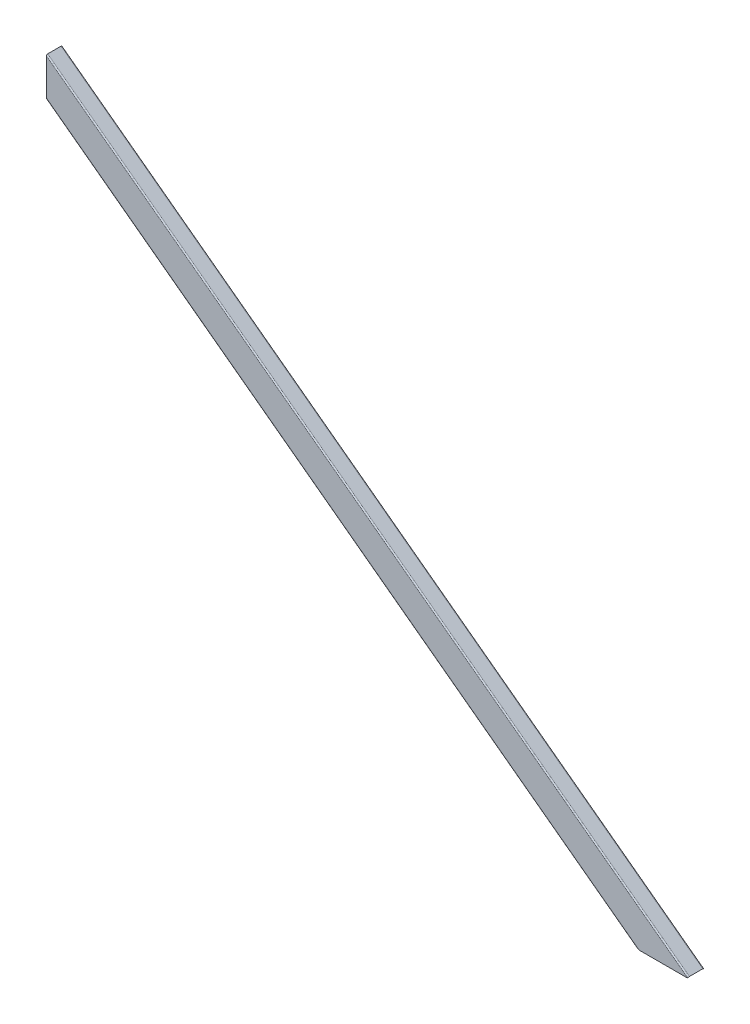
ISO-10303-21;
HEADER;
FILE_DESCRIPTION(('STEP AP214'),'2;1');
FILE_NAME('part.step','',(''),(''),'','','');
FILE_SCHEMA(('AUTOMOTIVE_DESIGN { 1 0 10303 214 1 1 1 1 }'));
ENDSEC;
DATA;
#1=APPLICATION_CONTEXT('core data for automotive mechanical design processes');
#2=APPLICATION_PROTOCOL_DEFINITION('international standard','automotive_design',2000,#1);
#3=PRODUCT_CONTEXT('',#1,'mechanical');
#4=PRODUCT('Part','Part','',(#3));
#5=PRODUCT_RELATED_PRODUCT_CATEGORY('part','',(#4));
#6=PRODUCT_DEFINITION_FORMATION('','',#4);
#7=PRODUCT_DEFINITION_CONTEXT('part definition',#1,'design');
#8=PRODUCT_DEFINITION('design','',#6,#7);
#9=PRODUCT_DEFINITION_SHAPE('','',#8);
#10=(LENGTH_UNIT() NAMED_UNIT(*) SI_UNIT(.MILLI.,.METRE.));
#11=(NAMED_UNIT(*) PLANE_ANGLE_UNIT() SI_UNIT($,.RADIAN.));
#12=(NAMED_UNIT(*) SI_UNIT($,.STERADIAN.) SOLID_ANGLE_UNIT());
#13=UNCERTAINTY_MEASURE_WITH_UNIT(LENGTH_MEASURE(1.E-05),#10,'distance_accuracy_value','');
#14=(GEOMETRIC_REPRESENTATION_CONTEXT(3) GLOBAL_UNCERTAINTY_ASSIGNED_CONTEXT((#13)) GLOBAL_UNIT_ASSIGNED_CONTEXT((#10,
#11,#12)) REPRESENTATION_CONTEXT('',''));
#15=CARTESIAN_POINT('',(0.,0.,0.));
#16=DIRECTION('',(0.,0.,1.));
#17=DIRECTION('',(1.,0.,0.));
#18=AXIS2_PLACEMENT_3D('',#15,#16,#17);
#19=CARTESIAN_POINT('',(-29.2392831235084,628.7958704326,1.500000000002));
#20=DIRECTION('',(0.,0.,1.));
#21=DIRECTION('',(0.,-1.,0.));
#22=AXIS2_PLACEMENT_3D('',#19,#20,#21);
#23=PLANE('',#22);
#24=DIRECTION('',(0.801911703745771,-0.597442565771434,0.));
#25=VECTOR('',#24,1.);
#26=CARTESIAN_POINT('',(-51.3446580570515,599.125137394006,1.500000000002));
#27=LINE('',#26,#25);
#28=CARTESIAN_POINT('',(1.11022302462516E-13,560.872192456334,1.500000000002));
#29=VERTEX_POINT('',#28);
#30=CARTESIAN_POINT('',(754.838822723645,-1.50000000000003,1.50000000000178));
#31=VERTEX_POINT('',#30);
#32=EDGE_CURVE('E225',#29,#31,#27,.T.);
#33=ORIENTED_EDGE('',*,*,#32,.T.);
#34=DIRECTION('',(1.,0.,0.));
#35=VECTOR('',#34,1.);
#36=CARTESIAN_POINT('',(-732.733197448332,-1.50000000000003,1.50000000000178));
#37=LINE('',#36,#35);
#38=CARTESIAN_POINT('',(816.149268234023,-1.50000000000003,1.50000000000178));
#39=VERTEX_POINT('',#38);
#40=EDGE_CURVE('E228',#31,#39,#37,.T.);
#41=ORIENTED_EDGE('',*,*,#40,.T.);
#42=DIRECTION('',(-0.597442565771434,-0.801911703745771,0.));
#43=VECTOR('',#42,1.);
#44=CARTESIAN_POINT('',(816.370638703011,-1.20286755561877,1.50000000000189));
#45=LINE('',#44,#43);
#46=CARTESIAN_POINT('',(816.370638703011,-1.20286755561877,1.50000000000189));
#47=VERTEX_POINT('',#46);
#48=EDGE_CURVE('E190',#47,#39,#45,.T.);
#49=ORIENTED_EDGE('',*,*,#48,.F.);
#50=DIRECTION('',(0.801911703745771,-0.597442565771434,0.));
#51=VECTOR('',#50,1.);
#52=CARTESIAN_POINT('',(-29.2392831235084,628.7958704326,1.500000000002));
#53=LINE('',#52,#51);
#54=CARTESIAN_POINT('',(1.11022302462516E-13,607.011935556692,1.500000000002));
#55=VERTEX_POINT('',#54);
#56=EDGE_CURVE('E222',#55,#47,#53,.T.);
#57=ORIENTED_EDGE('',*,*,#56,.F.);
#58=DIRECTION('',(0.,-1.,0.));
#59=VECTOR('',#58,1.);
#60=CARTESIAN_POINT('',(1.11022302462516E-13,628.7958704326,1.500000000002));
#61=LINE('',#60,#59);
#62=EDGE_CURVE('E209',#55,#29,#61,.T.);
#63=ORIENTED_EDGE('',*,*,#62,.T.);
#64=EDGE_LOOP('',(#33,#41,#49,#57,#63));
#65=FACE_BOUND('',#64,.T.);
#66=ADVANCED_FACE('F34',(#65),#23,.T.);
#67=CARTESIAN_POINT('',(-29.8367256892799,627.993958728854,1.99840144432528E-12));
#68=DIRECTION('',(0.,0.,1.));
#69=DIRECTION('',(0.,-1.,0.));
#70=AXIS2_PLACEMENT_3D('',#67,#68,#69);
#71=PLANE('',#70);
#72=DIRECTION('',(0.801911703745771,-0.597442565771434,0.));
#73=VECTOR('',#72,1.);
#74=CARTESIAN_POINT('',(-29.8367256892799,627.993958728854,1.99840144432528E-12));
#75=LINE('',#74,#73);
#76=CARTESIAN_POINT('',(1.11022302462516E-13,605.764915472898,1.99840144432528E-12));
#77=VERTEX_POINT('',#76);
#78=CARTESIAN_POINT('',(813.082299901155,0.,1.88737914186277E-12));
#79=VERTEX_POINT('',#78);
#80=EDGE_CURVE('E205',#77,#79,#75,.T.);
#81=ORIENTED_EDGE('',*,*,#80,.T.);
#82=DIRECTION('',(1.,0.,0.));
#83=VECTOR('',#82,1.);
#84=CARTESIAN_POINT('',(-732.733197448332,0.,1.77635683940025E-12));
#85=LINE('',#84,#83);
#86=CARTESIAN_POINT('',(754.499262793969,0.,1.77635683940025E-12));
#87=VERTEX_POINT('',#86);
#88=EDGE_CURVE('E304',#87,#79,#85,.T.);
#89=ORIENTED_EDGE('',*,*,#88,.F.);
#90=DIRECTION('',(0.801911703745771,-0.597442565771434,0.));
#91=VECTOR('',#90,1.);
#92=CARTESIAN_POINT('',(-50.74721549128,599.927049097752,1.99840144432528E-12));
#93=LINE('',#92,#91);
#94=CARTESIAN_POINT('',(1.11022302462516E-13,562.119212540127,1.99840144432528E-12));
#95=VERTEX_POINT('',#94);
#96=EDGE_CURVE('E210',#95,#87,#93,.T.);
#97=ORIENTED_EDGE('',*,*,#96,.F.);
#98=DIRECTION('',(0.,-1.,0.));
#99=VECTOR('',#98,1.);
#100=CARTESIAN_POINT('',(1.11022302462516E-13,627.993958728854,1.99840144432528E-12));
#101=LINE('',#100,#99);
#102=EDGE_CURVE('E269',#77,#95,#101,.T.);
#103=ORIENTED_EDGE('',*,*,#102,.F.);
#104=EDGE_LOOP('',(#81,#89,#97,#103));
#105=FACE_BOUND('',#104,.T.);
#106=ADVANCED_FACE('F320',(#105),#71,.F.);
#107=CARTESIAN_POINT('',(816.370638703011,-1.20286755561877,-16.9999999999981));
#108=DIRECTION('',(-0.801911703745771,0.597442565771435,0.));
#109=DIRECTION('',(-0.597442565771435,-0.801911703745771,0.));
#110=AXIS2_PLACEMENT_3D('',#107,#108,#109);
#111=PLANE('',#110);
#112=CARTESIAN_POINT('',(816.370638703011,-1.20286755561877,-16.9999999999981));
#113=DIRECTION('',(0.801911703745771,-0.597442565771435,0.));
#114=DIRECTION('',(-0.597442565771435,-0.801911703745771,0.));
#115=AXIS2_PLACEMENT_3D('',#112,#113,#114);
#116=CIRCLE('',#115,1.49999999999999);
#117=CARTESIAN_POINT('',(816.370638703011,-1.20286755561877,-18.4999999999981));
#118=VERTEX_POINT('',#117);
#119=CARTESIAN_POINT('',(817.266802551668,0.,-16.9999999999981));
#120=VERTEX_POINT('',#119);
#121=EDGE_CURVE('E208',#118,#120,#116,.T.);
#122=ORIENTED_EDGE('',*,*,#121,.T.);
#123=CARTESIAN_POINT('',(816.149268234023,-1.50000000000003,-16.9999999999982));
#124=DIRECTION('',(-0.801911703745771,0.597442565771435,0.));
#125=DIRECTION('',(0.597442565771435,0.801911703745771,0.));
#126=AXIS2_PLACEMENT_3D('',#123,#124,#125);
#127=ELLIPSE('',#126,1.87053012569018,1.5);
#128=CARTESIAN_POINT('',(816.149268234023,-1.5000000000001,-18.4999999999982));
#129=VERTEX_POINT('',#128);
#130=EDGE_CURVE('E169',#120,#129,#127,.T.);
#131=ORIENTED_EDGE('',*,*,#130,.T.);
#132=DIRECTION('',(0.597442565771434,0.801911703745771,0.));
#133=VECTOR('',#132,1.);
#134=CARTESIAN_POINT('',(816.370638703011,-1.20286755561877,-18.4999999999981));
#135=LINE('',#134,#133);
#136=EDGE_CURVE('E261',#129,#118,#135,.T.);
#137=ORIENTED_EDGE('',*,*,#136,.T.);
#138=EDGE_LOOP('',(#122,#131,#137));
#139=FACE_BOUND('',#138,.T.);
#140=ADVANCED_FACE('F345',(#139),#111,.F.);
#141=CARTESIAN_POINT('',(-29.2392831235084,628.7958704326,-16.999999999998));
#142=DIRECTION('',(0.801911703745771,-0.597442565771434,0.));
#143=DIRECTION('',(0.597442565771435,0.801911703745771,0.));
#144=AXIS2_PLACEMENT_3D('',#141,#142,#143);
#145=CYLINDRICAL_SURFACE('',#144,1.49999999999999);
#146=DIRECTION('',(0.801911703745771,-0.597442565771434,0.));
#147=VECTOR('',#146,1.);
#148=CARTESIAN_POINT('',(-29.2392831235084,628.7958704326,-18.499999999998));
#149=LINE('',#148,#147);
#150=CARTESIAN_POINT('',(1.11022302462516E-13,607.011935556692,-18.499999999998));
#151=VERTEX_POINT('',#150);
#152=EDGE_CURVE('E241',#151,#118,#149,.T.);
#153=ORIENTED_EDGE('',*,*,#152,.F.);
#154=CARTESIAN_POINT('',(1.11022302462516E-13,607.011935556692,-16.999999999998));
#155=DIRECTION('',(-1.,0.,0.));
#156=DIRECTION('',(0.,-1.,0.));
#157=AXIS2_PLACEMENT_3D('',#154,#155,#156);
#158=ELLIPSE('',#157,1.87053012569016,1.49999999999999);
#159=CARTESIAN_POINT('',(1.11022302462516E-13,608.882465682382,-16.9999999999981));
#160=VERTEX_POINT('',#159);
#161=EDGE_CURVE('E217',#151,#160,#158,.F.);
#162=ORIENTED_EDGE('',*,*,#161,.T.);
#163=DIRECTION('',(0.801911703745771,-0.597442565771434,0.));
#164=VECTOR('',#163,1.);
#165=CARTESIAN_POINT('',(-28.3431192748513,629.998737988218,-16.999999999998));
#166=LINE('',#165,#164);
#167=EDGE_CURVE('E214',#160,#120,#166,.T.);
#168=ORIENTED_EDGE('',*,*,#167,.T.);
#169=ORIENTED_EDGE('',*,*,#121,.F.);
#170=EDGE_LOOP('',(#153,#162,#168,#169));
#171=FACE_BOUND('',#170,.T.);
#172=ADVANCED_FACE('F381',(#171),#145,.T.);
#173=CARTESIAN_POINT('',(-29.2392831235084,628.7958704326,-18.499999999998));
#174=DIRECTION('',(0.,0.,-1.));
#175=DIRECTION('',(0.,1.,0.));
#176=AXIS2_PLACEMENT_3D('',#173,#174,#175);
#177=PLANE('',#176);
#178=DIRECTION('',(1.,0.,0.));
#179=VECTOR('',#178,1.);
#180=CARTESIAN_POINT('',(-732.733197448332,-1.50000000000003,-18.4999999999982));
#181=LINE('',#180,#179);
#182=CARTESIAN_POINT('',(754.838822723645,-1.5000000000001,-18.4999999999982));
#183=VERTEX_POINT('',#182);
#184=EDGE_CURVE('E293',#183,#129,#181,.T.);
#185=ORIENTED_EDGE('',*,*,#184,.F.);
#186=DIRECTION('',(0.801911703745771,-0.597442565771434,0.));
#187=VECTOR('',#186,1.);
#188=CARTESIAN_POINT('',(-51.3446580570515,599.125137394006,-18.499999999998));
#189=LINE('',#188,#187);
#190=CARTESIAN_POINT('',(1.11022302462516E-13,560.872192456334,-18.499999999998));
#191=VERTEX_POINT('',#190);
#192=EDGE_CURVE('E237',#191,#183,#189,.T.);
#193=ORIENTED_EDGE('',*,*,#192,.F.);
#194=DIRECTION('',(0.,1.,0.));
#195=VECTOR('',#194,1.);
#196=CARTESIAN_POINT('',(1.11022302462516E-13,628.7958704326,-18.499999999998));
#197=LINE('',#196,#195);
#198=EDGE_CURVE('E216',#191,#151,#197,.T.);
#199=ORIENTED_EDGE('',*,*,#198,.T.);
#200=ORIENTED_EDGE('',*,*,#152,.T.);
#201=ORIENTED_EDGE('',*,*,#136,.F.);
#202=EDGE_LOOP('',(#185,#193,#199,#200,#201));
#203=FACE_BOUND('',#202,.T.);
#204=ADVANCED_FACE('F384',(#203),#177,.T.);
#205=CARTESIAN_POINT('',(-51.3446580570515,599.125137394006,-16.999999999998));
#206=DIRECTION('',(0.801911703745771,-0.597442565771434,0.));
#207=DIRECTION('',(0.597442565771435,0.801911703745771,0.));
#208=AXIS2_PLACEMENT_3D('',#205,#206,#207);
#209=CYLINDRICAL_SURFACE('',#208,1.50000000000002);
#210=CARTESIAN_POINT('',(754.838822723645,-1.50000000000004,-16.9999999999982));
#211=DIRECTION('',(-0.314712802610753,-0.94918694253181,0.));
#212=DIRECTION('',(0.94918694253181,-0.314712802610753,0.));
#213=AXIS2_PLACEMENT_3D('',#210,#211,#212);
#214=ELLIPSE('',#213,4.76625033222834,1.50000000000001);
#215=CARTESIAN_POINT('',(750.314760143456,0.,-16.9999999999982));
#216=VERTEX_POINT('',#215);
#217=EDGE_CURVE('E291',#216,#183,#214,.T.);
#218=ORIENTED_EDGE('',*,*,#217,.F.);
#219=DIRECTION('',(0.801911703745771,-0.597442565771434,0.));
#220=VECTOR('',#219,1.);
#221=CARTESIAN_POINT('',(-52.2408219057087,597.922269838387,-16.999999999998));
#222=LINE('',#221,#220);
#223=CARTESIAN_POINT('',(1.11022302462516E-13,559.001662330644,-16.9999999999981));
#224=VERTEX_POINT('',#223);
#225=EDGE_CURVE('E233',#224,#216,#222,.T.);
#226=ORIENTED_EDGE('',*,*,#225,.F.);
#227=CARTESIAN_POINT('',(1.11022302462516E-13,560.872192456334,-16.999999999998));
#228=DIRECTION('',(-1.,0.,0.));
#229=DIRECTION('',(0.,-1.,0.));
#230=AXIS2_PLACEMENT_3D('',#227,#228,#229);
#231=ELLIPSE('',#230,1.8705301256902,1.50000000000002);
#232=EDGE_CURVE('E240',#224,#191,#231,.F.);
#233=ORIENTED_EDGE('',*,*,#232,.T.);
#234=ORIENTED_EDGE('',*,*,#192,.T.);
#235=EDGE_LOOP('',(#218,#226,#233,#234));
#236=FACE_BOUND('',#235,.T.);
#237=ADVANCED_FACE('F387',(#236),#209,.T.);
#238=CARTESIAN_POINT('',(-52.2408219057087,597.922269838387,1.99840144432528E-12));
#239=DIRECTION('',(-0.597442565771434,-0.801911703745771,0.));
#240=DIRECTION('',(0.801911703745771,-0.597442565771435,0.));
#241=AXIS2_PLACEMENT_3D('',#238,#239,#240);
#242=PLANE('',#241);
#243=DIRECTION('',(0.,0.,-1.));
#244=VECTOR('',#243,1.);
#245=CARTESIAN_POINT('',(750.314760143456,0.,1.99840144432528E-12));
#246=LINE('',#245,#244);
#247=CARTESIAN_POINT('',(750.314760143456,0.,1.77635683940025E-12));
#248=VERTEX_POINT('',#247);
#249=EDGE_CURVE('E44',#248,#216,#246,.T.);
#250=ORIENTED_EDGE('',*,*,#249,.F.);
#251=DIRECTION('',(0.801911703745771,-0.597442565771434,0.));
#252=VECTOR('',#251,1.);
#253=CARTESIAN_POINT('',(-52.2408219057087,597.922269838387,1.99840144432528E-12));
#254=LINE('',#253,#252);
#255=CARTESIAN_POINT('',(1.11022302462516E-13,559.001662330644,1.99840144432528E-12));
#256=VERTEX_POINT('',#255);
#257=EDGE_CURVE('E229',#256,#248,#254,.T.);
#258=ORIENTED_EDGE('',*,*,#257,.F.);
#259=DIRECTION('',(0.,0.,-1.));
#260=VECTOR('',#259,1.);
#261=CARTESIAN_POINT('',(1.11022302462516E-13,559.001662330644,1.99840144432528E-12));
#262=LINE('',#261,#260);
#263=EDGE_CURVE('E236',#256,#224,#262,.T.);
#264=ORIENTED_EDGE('',*,*,#263,.T.);
#265=ORIENTED_EDGE('',*,*,#225,.T.);
#266=EDGE_LOOP('',(#250,#258,#264,#265));
#267=FACE_BOUND('',#266,.T.);
#268=ADVANCED_FACE('F36',(#267),#242,.T.);
#269=CARTESIAN_POINT('',(-51.3446580570515,599.125137394006,1.99840144432528E-12));
#270=DIRECTION('',(0.801911703745771,-0.597442565771434,0.));
#271=DIRECTION('',(0.597442565771435,0.801911703745771,0.));
#272=AXIS2_PLACEMENT_3D('',#269,#270,#271);
#273=CYLINDRICAL_SURFACE('',#272,1.50000000000002);
#274=CARTESIAN_POINT('',(754.838822723645,-1.50000000000004,1.83186799063151E-12));
#275=DIRECTION('',(-0.314712802610753,-0.94918694253181,0.));
#276=DIRECTION('',(0.94918694253181,-0.314712802610753,0.));
#277=AXIS2_PLACEMENT_3D('',#274,#275,#276);
#278=ELLIPSE('',#277,4.76625033222834,1.50000000000001);
#279=EDGE_CURVE('E68',#31,#248,#278,.T.);
#280=ORIENTED_EDGE('',*,*,#279,.F.);
#281=ORIENTED_EDGE('',*,*,#32,.F.);
#282=CARTESIAN_POINT('',(1.11022302462516E-13,560.872192456334,1.99840144432528E-12));
#283=DIRECTION('',(-1.,0.,0.));
#284=DIRECTION('',(0.,-1.,0.));
#285=AXIS2_PLACEMENT_3D('',#282,#283,#284);
#286=ELLIPSE('',#285,1.8705301256902,1.50000000000002);
#287=EDGE_CURVE('E232',#29,#256,#286,.F.);
#288=ORIENTED_EDGE('',*,*,#287,.T.);
#289=ORIENTED_EDGE('',*,*,#257,.T.);
#290=EDGE_LOOP('',(#280,#281,#288,#289));
#291=FACE_BOUND('',#290,.T.);
#292=ADVANCED_FACE('F349',(#291),#273,.T.);
#293=CARTESIAN_POINT('',(-29.2392831235084,628.7958704326,1.99840144432528E-12));
#294=DIRECTION('',(0.801911703745771,-0.597442565771434,0.));
#295=DIRECTION('',(0.597442565771435,0.801911703745771,0.));
#296=AXIS2_PLACEMENT_3D('',#293,#294,#295);
#297=CYLINDRICAL_SURFACE('',#296,1.49999999999999);
#298=DIRECTION('',(0.801911703745771,-0.597442565771434,0.));
#299=VECTOR('',#298,1.);
#300=CARTESIAN_POINT('',(-28.3431192748513,629.998737988218,1.99840144432528E-12));
#301=LINE('',#300,#299);
#302=CARTESIAN_POINT('',(1.11022302462516E-13,608.882465682382,1.99840144432528E-12));
#303=VERTEX_POINT('',#302);
#304=CARTESIAN_POINT('',(817.266802551668,0.,1.77635683940025E-12));
#305=VERTEX_POINT('',#304);
#306=EDGE_CURVE('E218',#303,#305,#301,.T.);
#307=ORIENTED_EDGE('',*,*,#306,.F.);
#308=CARTESIAN_POINT('',(1.11022302462516E-13,607.011935556692,1.99840144432528E-12));
#309=DIRECTION('',(-1.,0.,0.));
#310=DIRECTION('',(0.,-1.,0.));
#311=AXIS2_PLACEMENT_3D('',#308,#309,#310);
#312=ELLIPSE('',#311,1.87053012569016,1.49999999999999);
#313=EDGE_CURVE('E224',#303,#55,#312,.F.);
#314=ORIENTED_EDGE('',*,*,#313,.T.);
#315=ORIENTED_EDGE('',*,*,#56,.T.);
#316=CARTESIAN_POINT('',(816.370638703011,-1.20286755561877,1.88737914186277E-12));
#317=DIRECTION('',(0.801911703745771,-0.597442565771435,0.));
#318=DIRECTION('',(-0.597442565771435,-0.801911703745771,0.));
#319=AXIS2_PLACEMENT_3D('',#316,#317,#318);
#320=CIRCLE('',#319,1.49999999999999);
#321=EDGE_CURVE('E277',#305,#47,#320,.T.);
#322=ORIENTED_EDGE('',*,*,#321,.F.);
#323=EDGE_LOOP('',(#307,#314,#315,#322));
#324=FACE_BOUND('',#323,.T.);
#325=ADVANCED_FACE('F336',(#324),#297,.T.);
#326=CARTESIAN_POINT('',(-28.3431192748513,629.998737988218,1.99840144432528E-12));
#327=DIRECTION('',(0.597442565771434,0.801911703745771,0.));
#328=DIRECTION('',(-0.801911703745771,0.597442565771435,0.));
#329=AXIS2_PLACEMENT_3D('',#326,#327,#328);
#330=PLANE('',#329);
#331=ORIENTED_EDGE('',*,*,#167,.F.);
#332=DIRECTION('',(0.,0.,1.));
#333=VECTOR('',#332,1.);
#334=CARTESIAN_POINT('',(1.11022302462516E-13,608.882465682382,1.99840144432528E-12));
#335=LINE('',#334,#333);
#336=EDGE_CURVE('E221',#160,#303,#335,.T.);
#337=ORIENTED_EDGE('',*,*,#336,.T.);
#338=ORIENTED_EDGE('',*,*,#306,.T.);
#339=DIRECTION('',(0.,0.,1.));
#340=VECTOR('',#339,1.);
#341=CARTESIAN_POINT('',(817.266802551668,0.,1.88737914186277E-12));
#342=LINE('',#341,#340);
#343=EDGE_CURVE('E172',#120,#305,#342,.T.);
#344=ORIENTED_EDGE('',*,*,#343,.F.);
#345=EDGE_LOOP('',(#331,#337,#338,#344));
#346=FACE_BOUND('',#345,.T.);
#347=ADVANCED_FACE('F330',(#346),#330,.T.);
#348=CARTESIAN_POINT('',(-50.74721549128,599.927049097752,-15.999999999998));
#349=DIRECTION('',(0.801911703745771,-0.597442565771434,0.));
#350=DIRECTION('',(0.597442565771435,0.801911703745771,0.));
#351=AXIS2_PLACEMENT_3D('',#348,#349,#350);
#352=CYLINDRICAL_SURFACE('',#351,0.999999999999995);
#353=DIRECTION('',(0.801911703745771,-0.597442565771434,0.));
#354=VECTOR('',#353,1.);
#355=CARTESIAN_POINT('',(-51.3446580570515,599.125137394006,-15.999999999998));
#356=LINE('',#355,#354);
#357=CARTESIAN_POINT('',(1.11022302462516E-13,560.872192456334,-15.999999999998));
#358=VERTEX_POINT('',#357);
#359=CARTESIAN_POINT('',(752.825461733764,0.,-15.9999999999981));
#360=VERTEX_POINT('',#359);
#361=EDGE_CURVE('E38',#358,#360,#356,.T.);
#362=ORIENTED_EDGE('',*,*,#361,.T.);
#363=CARTESIAN_POINT('',(754.499262793969,1.11022302462516E-13,-15.9999999999981));
#364=DIRECTION('',(0.,1.,0.));
#365=DIRECTION('',(1.,0.,0.));
#366=AXIS2_PLACEMENT_3D('',#363,#364,#365);
#367=ELLIPSE('',#366,1.67380106020529,0.999999999999995);
#368=CARTESIAN_POINT('',(754.499262793969,0.,-16.9999999999982));
#369=VERTEX_POINT('',#368);
#370=EDGE_CURVE('E94',#360,#369,#367,.F.);
#371=ORIENTED_EDGE('',*,*,#370,.T.);
#372=DIRECTION('',(0.801911703745771,-0.597442565771434,0.));
#373=VECTOR('',#372,1.);
#374=CARTESIAN_POINT('',(-50.74721549128,599.927049097752,-16.999999999998));
#375=LINE('',#374,#373);
#376=CARTESIAN_POINT('',(1.11022302462516E-13,562.119212540127,-16.999999999998));
#377=VERTEX_POINT('',#376);
#378=EDGE_CURVE('E182',#377,#369,#375,.T.);
#379=ORIENTED_EDGE('',*,*,#378,.F.);
#380=CARTESIAN_POINT('',(1.11022302462516E-13,562.119212540127,-15.999999999998));
#381=DIRECTION('',(-1.,0.,0.));
#382=DIRECTION('',(0.,-1.,0.));
#383=AXIS2_PLACEMENT_3D('',#380,#381,#382);
#384=ELLIPSE('',#383,1.24702008379344,0.999999999999995);
#385=EDGE_CURVE('E246',#358,#377,#384,.F.);
#386=ORIENTED_EDGE('',*,*,#385,.F.);
#387=EDGE_LOOP('',(#362,#371,#379,#386));
#388=FACE_BOUND('',#387,.T.);
#389=ADVANCED_FACE('F328',(#388),#352,.F.);
#390=CARTESIAN_POINT('',(-51.3446580570515,599.125137394006,-0.999999999998002));
#391=DIRECTION('',(-0.597442565771434,-0.801911703745771,0.));
#392=DIRECTION('',(0.801911703745771,-0.597442565771435,0.));
#393=AXIS2_PLACEMENT_3D('',#390,#391,#392);
#394=PLANE('',#393);
#395=DIRECTION('',(0.801911703745771,-0.597442565771434,0.));
#396=VECTOR('',#395,1.);
#397=CARTESIAN_POINT('',(-51.3446580570515,599.125137394006,-0.999999999998002));
#398=LINE('',#397,#396);
#399=CARTESIAN_POINT('',(1.11022302462516E-13,560.872192456334,-0.999999999998002));
#400=VERTEX_POINT('',#399);
#401=CARTESIAN_POINT('',(752.825461733764,1.11022302462516E-13,-0.999999999998114));
#402=VERTEX_POINT('',#401);
#403=EDGE_CURVE('E299',#400,#402,#398,.T.);
#404=ORIENTED_EDGE('',*,*,#403,.T.);
#405=DIRECTION('',(0.,0.,-1.));
#406=VECTOR('',#405,1.);
#407=CARTESIAN_POINT('',(752.825461733764,0.,-0.999999999997003));
#408=LINE('',#407,#406);
#409=EDGE_CURVE('E213',#402,#360,#408,.T.);
#410=ORIENTED_EDGE('',*,*,#409,.T.);
#411=ORIENTED_EDGE('',*,*,#361,.F.);
#412=DIRECTION('',(0.,0.,-1.));
#413=VECTOR('',#412,1.);
#414=CARTESIAN_POINT('',(1.11022302462516E-13,560.872192456334,-0.999999999998002));
#415=LINE('',#414,#413);
#416=EDGE_CURVE('E274',#400,#358,#415,.T.);
#417=ORIENTED_EDGE('',*,*,#416,.F.);
#418=EDGE_LOOP('',(#404,#410,#411,#417));
#419=FACE_BOUND('',#418,.T.);
#420=ADVANCED_FACE('F310',(#419),#394,.F.);
#421=CARTESIAN_POINT('',(-50.74721549128,599.927049097752,-0.999999999998002));
#422=DIRECTION('',(0.801911703745771,-0.597442565771434,0.));
#423=DIRECTION('',(0.597442565771435,0.801911703745771,0.));
#424=AXIS2_PLACEMENT_3D('',#421,#422,#423);
#425=CYLINDRICAL_SURFACE('',#424,0.999999999999997);
#426=ORIENTED_EDGE('',*,*,#96,.T.);
#427=CARTESIAN_POINT('',(754.499262793969,1.11022302462516E-13,-0.999999999998114));
#428=DIRECTION('',(0.,1.,0.));
#429=DIRECTION('',(1.,0.,0.));
#430=AXIS2_PLACEMENT_3D('',#427,#428,#429);
#431=ELLIPSE('',#430,1.67380106020529,0.999999999999997);
#432=EDGE_CURVE('E55',#87,#402,#431,.F.);
#433=ORIENTED_EDGE('',*,*,#432,.T.);
#434=ORIENTED_EDGE('',*,*,#403,.F.);
#435=CARTESIAN_POINT('',(1.11022302462516E-13,562.119212540127,-0.999999999998002));
#436=DIRECTION('',(-1.,0.,0.));
#437=DIRECTION('',(0.,-1.,0.));
#438=AXIS2_PLACEMENT_3D('',#435,#436,#437);
#439=ELLIPSE('',#438,1.24702008379345,0.999999999999997);
#440=EDGE_CURVE('E173',#95,#400,#439,.F.);
#441=ORIENTED_EDGE('',*,*,#440,.F.);
#442=EDGE_LOOP('',(#426,#433,#434,#441));
#443=FACE_BOUND('',#442,.T.);
#444=ADVANCED_FACE('F314',(#443),#425,.F.);
#445=CARTESIAN_POINT('',(-29.8367256892799,627.993958728854,-0.999999999998002));
#446=DIRECTION('',(0.801911703745771,-0.597442565771434,0.));
#447=DIRECTION('',(0.597442565771435,0.801911703745771,0.));
#448=AXIS2_PLACEMENT_3D('',#445,#446,#447);
#449=CYLINDRICAL_SURFACE('',#448,0.999999999999998);
#450=DIRECTION('',(0.801911703745771,-0.597442565771434,0.));
#451=VECTOR('',#450,1.);
#452=CARTESIAN_POINT('',(-29.2392831235084,628.7958704326,-0.999999999998002));
#453=LINE('',#452,#451);
#454=CARTESIAN_POINT('',(1.11022302462516E-13,607.011935556692,-0.999999999998002));
#455=VERTEX_POINT('',#454);
#456=CARTESIAN_POINT('',(814.75610096136,0.,-0.999999999998002));
#457=VERTEX_POINT('',#456);
#458=EDGE_CURVE('E202',#455,#457,#453,.T.);
#459=ORIENTED_EDGE('',*,*,#458,.T.);
#460=CARTESIAN_POINT('',(813.082299901155,0.,-0.999999999998114));
#461=DIRECTION('',(0.,1.,0.));
#462=DIRECTION('',(1.,0.,0.));
#463=AXIS2_PLACEMENT_3D('',#460,#461,#462);
#464=ELLIPSE('',#463,1.67380106020529,0.999999999999998);
#465=EDGE_CURVE('E77',#457,#79,#464,.F.);
#466=ORIENTED_EDGE('',*,*,#465,.T.);
#467=ORIENTED_EDGE('',*,*,#80,.F.);
#468=CARTESIAN_POINT('',(1.11022302462516E-13,605.764915472898,-0.999999999998002));
#469=DIRECTION('',(-1.,0.,0.));
#470=DIRECTION('',(0.,-1.,0.));
#471=AXIS2_PLACEMENT_3D('',#468,#469,#470);
#472=ELLIPSE('',#471,1.24702008379345,0.999999999999998);
#473=EDGE_CURVE('E266',#455,#77,#472,.F.);
#474=ORIENTED_EDGE('',*,*,#473,.F.);
#475=EDGE_LOOP('',(#459,#466,#467,#474));
#476=FACE_BOUND('',#475,.T.);
#477=ADVANCED_FACE('F323',(#476),#449,.F.);
#478=CARTESIAN_POINT('',(-29.2392831235084,628.7958704326,-0.999999999998002));
#479=DIRECTION('',(0.597442565771434,0.801911703745771,0.));
#480=DIRECTION('',(-0.801911703745771,0.597442565771435,0.));
#481=AXIS2_PLACEMENT_3D('',#478,#479,#480);
#482=PLANE('',#481);
#483=DIRECTION('',(0.801911703745771,-0.597442565771434,0.));
#484=VECTOR('',#483,1.);
#485=CARTESIAN_POINT('',(-29.2392831235084,628.7958704326,-15.999999999998));
#486=LINE('',#485,#484);
#487=CARTESIAN_POINT('',(1.11022302462516E-13,607.011935556692,-15.999999999998));
#488=VERTEX_POINT('',#487);
#489=CARTESIAN_POINT('',(814.75610096136,0.,-15.9999999999981));
#490=VERTEX_POINT('',#489);
#491=EDGE_CURVE('E196',#488,#490,#486,.T.);
#492=ORIENTED_EDGE('',*,*,#491,.T.);
#493=DIRECTION('',(0.,0.,1.));
#494=VECTOR('',#493,1.);
#495=CARTESIAN_POINT('',(814.75610096136,0.,-0.999999999997447));
#496=LINE('',#495,#494);
#497=EDGE_CURVE('E177',#490,#457,#496,.T.);
#498=ORIENTED_EDGE('',*,*,#497,.T.);
#499=ORIENTED_EDGE('',*,*,#458,.F.);
#500=DIRECTION('',(0.,0.,1.));
#501=VECTOR('',#500,1.);
#502=CARTESIAN_POINT('',(1.11022302462516E-13,607.011935556692,-0.999999999998002));
#503=LINE('',#502,#501);
#504=EDGE_CURVE('E263',#488,#455,#503,.T.);
#505=ORIENTED_EDGE('',*,*,#504,.F.);
#506=EDGE_LOOP('',(#492,#498,#499,#505));
#507=FACE_BOUND('',#506,.T.);
#508=ADVANCED_FACE('F326',(#507),#482,.F.);
#509=CARTESIAN_POINT('',(-29.8367256892799,627.993958728854,-15.999999999998));
#510=DIRECTION('',(0.801911703745771,-0.597442565771434,0.));
#511=DIRECTION('',(0.597442565771435,0.801911703745771,0.));
#512=AXIS2_PLACEMENT_3D('',#509,#510,#511);
#513=CYLINDRICAL_SURFACE('',#512,1.);
#514=DIRECTION('',(0.801911703745771,-0.597442565771434,0.));
#515=VECTOR('',#514,1.);
#516=CARTESIAN_POINT('',(-29.8367256892799,627.993958728854,-16.999999999998));
#517=LINE('',#516,#515);
#518=CARTESIAN_POINT('',(1.11022302462516E-13,605.764915472898,-16.999999999998));
#519=VERTEX_POINT('',#518);
#520=CARTESIAN_POINT('',(813.082299901155,0.,-16.9999999999981));
#521=VERTEX_POINT('',#520);
#522=EDGE_CURVE('E183',#519,#521,#517,.T.);
#523=ORIENTED_EDGE('',*,*,#522,.T.);
#524=CARTESIAN_POINT('',(813.082299901155,0.,-15.9999999999981));
#525=DIRECTION('',(0.,1.,0.));
#526=DIRECTION('',(1.,0.,0.));
#527=AXIS2_PLACEMENT_3D('',#524,#525,#526);
#528=ELLIPSE('',#527,1.6738010602053,1.);
#529=EDGE_CURVE('E175',#521,#490,#528,.F.);
#530=ORIENTED_EDGE('',*,*,#529,.T.);
#531=ORIENTED_EDGE('',*,*,#491,.F.);
#532=CARTESIAN_POINT('',(1.11022302462516E-13,605.764915472898,-15.999999999998));
#533=DIRECTION('',(-1.,0.,0.));
#534=DIRECTION('',(0.,-1.,0.));
#535=AXIS2_PLACEMENT_3D('',#532,#533,#534);
#536=ELLIPSE('',#535,1.24702008379345,1.);
#537=EDGE_CURVE('E193',#519,#488,#536,.F.);
#538=ORIENTED_EDGE('',*,*,#537,.F.);
#539=EDGE_LOOP('',(#523,#530,#531,#538));
#540=FACE_BOUND('',#539,.T.);
#541=ADVANCED_FACE('F191',(#540),#513,.F.);
#542=CARTESIAN_POINT('',(-29.8367256892799,627.993958728854,-16.999999999998));
#543=DIRECTION('',(0.,0.,-1.));
#544=DIRECTION('',(0.,1.,0.));
#545=AXIS2_PLACEMENT_3D('',#542,#543,#544);
#546=PLANE('',#545);
#547=ORIENTED_EDGE('',*,*,#378,.T.);
#548=DIRECTION('',(1.,0.,0.));
#549=VECTOR('',#548,1.);
#550=CARTESIAN_POINT('',(-732.733197448332,0.,-16.9999999999982));
#551=LINE('',#550,#549);
#552=EDGE_CURVE('E47',#369,#521,#551,.T.);
#553=ORIENTED_EDGE('',*,*,#552,.T.);
#554=ORIENTED_EDGE('',*,*,#522,.F.);
#555=DIRECTION('',(0.,1.,0.));
#556=VECTOR('',#555,1.);
#557=CARTESIAN_POINT('',(1.11022302462516E-13,627.993958728854,-16.999999999998));
#558=LINE('',#557,#556);
#559=EDGE_CURVE('E244',#377,#519,#558,.T.);
#560=ORIENTED_EDGE('',*,*,#559,.F.);
#561=EDGE_LOOP('',(#547,#553,#554,#560));
#562=FACE_BOUND('',#561,.T.);
#563=ADVANCED_FACE('F187',(#562),#546,.F.);
#564=ORIENTED_EDGE('',*,*,#48,.T.);
#565=CARTESIAN_POINT('',(816.149268234023,-1.50000000000003,1.77635683940025E-12));
#566=DIRECTION('',(-0.801911703745771,0.597442565771435,0.));
#567=DIRECTION('',(0.597442565771435,0.801911703745771,0.));
#568=AXIS2_PLACEMENT_3D('',#565,#566,#567);
#569=ELLIPSE('',#568,1.87053012569019,1.50000000000001);
#570=EDGE_CURVE('E287',#39,#305,#569,.T.);
#571=ORIENTED_EDGE('',*,*,#570,.T.);
#572=ORIENTED_EDGE('',*,*,#321,.T.);
#573=EDGE_LOOP('',(#564,#571,#572));
#574=FACE_BOUND('',#573,.T.);
#575=ADVANCED_FACE('F362',(#574),#111,.F.);
#576=CARTESIAN_POINT('',(1.11022302462516E-13,862.501,-16.9999999999491));
#577=DIRECTION('',(-1.,0.,0.));
#578=DIRECTION('',(0.,0.,1.));
#579=AXIS2_PLACEMENT_3D('',#576,#577,#578);
#580=PLANE('',#579);
#581=ORIENTED_EDGE('',*,*,#161,.F.);
#582=ORIENTED_EDGE('',*,*,#198,.F.);
#583=ORIENTED_EDGE('',*,*,#232,.F.);
#584=ORIENTED_EDGE('',*,*,#263,.F.);
#585=ORIENTED_EDGE('',*,*,#287,.F.);
#586=ORIENTED_EDGE('',*,*,#62,.F.);
#587=ORIENTED_EDGE('',*,*,#313,.F.);
#588=ORIENTED_EDGE('',*,*,#336,.F.);
#589=EDGE_LOOP('',(#581,#582,#583,#584,#585,#586,#587,#588));
#590=FACE_BOUND('',#589,.T.);
#591=ORIENTED_EDGE('',*,*,#416,.T.);
#592=ORIENTED_EDGE('',*,*,#385,.T.);
#593=ORIENTED_EDGE('',*,*,#559,.T.);
#594=ORIENTED_EDGE('',*,*,#537,.T.);
#595=ORIENTED_EDGE('',*,*,#504,.T.);
#596=ORIENTED_EDGE('',*,*,#473,.T.);
#597=ORIENTED_EDGE('',*,*,#102,.T.);
#598=ORIENTED_EDGE('',*,*,#440,.T.);
#599=EDGE_LOOP('',(#591,#592,#593,#594,#595,#596,#597,#598));
#600=FACE_BOUND('',#599,.T.);
#601=ADVANCED_FACE('F317',(#590,#600),#580,.T.);
#602=CARTESIAN_POINT('',(-732.733197448332,0.,1.77635683940025E-12));
#603=DIRECTION('',(0.,1.,0.));
#604=DIRECTION('',(1.,0.,0.));
#605=AXIS2_PLACEMENT_3D('',#602,#603,#604);
#606=PLANE('',#605);
#607=ORIENTED_EDGE('',*,*,#497,.F.);
#608=ORIENTED_EDGE('',*,*,#529,.F.);
#609=EDGE_CURVE('E46',#521,#120,#551,.T.);
#610=ORIENTED_EDGE('',*,*,#609,.T.);
#611=ORIENTED_EDGE('',*,*,#343,.T.);
#612=EDGE_CURVE('E294',#79,#305,#85,.T.);
#613=ORIENTED_EDGE('',*,*,#612,.F.);
#614=ORIENTED_EDGE('',*,*,#465,.F.);
#615=EDGE_LOOP('',(#607,#608,#610,#611,#613,#614));
#616=FACE_BOUND('',#615,.T.);
#617=ADVANCED_FACE('F176',(#616),#606,.F.);
#618=CARTESIAN_POINT('',(-732.733197448332,-1.50000000000003,1.77635683940025E-12));
#619=DIRECTION('',(1.,0.,0.));
#620=DIRECTION('',(0.,0.,-1.));
#621=AXIS2_PLACEMENT_3D('',#618,#619,#620);
#622=CYLINDRICAL_SURFACE('',#621,1.50000000000001);
#623=ORIENTED_EDGE('',*,*,#279,.T.);
#624=EDGE_CURVE('E296',#248,#87,#85,.T.);
#625=ORIENTED_EDGE('',*,*,#624,.T.);
#626=ORIENTED_EDGE('',*,*,#88,.T.);
#627=ORIENTED_EDGE('',*,*,#612,.T.);
#628=ORIENTED_EDGE('',*,*,#570,.F.);
#629=ORIENTED_EDGE('',*,*,#40,.F.);
#630=EDGE_LOOP('',(#623,#625,#626,#627,#628,#629));
#631=FACE_BOUND('',#630,.T.);
#632=ADVANCED_FACE('F357',(#631),#622,.F.);
#633=CARTESIAN_POINT('',(-732.733197448332,-1.50000000000003,-16.9999999999982));
#634=DIRECTION('',(1.,0.,0.));
#635=DIRECTION('',(0.,0.,-1.));
#636=AXIS2_PLACEMENT_3D('',#633,#634,#635);
#637=CYLINDRICAL_SURFACE('',#636,1.5);
#638=ORIENTED_EDGE('',*,*,#217,.T.);
#639=ORIENTED_EDGE('',*,*,#184,.T.);
#640=ORIENTED_EDGE('',*,*,#130,.F.);
#641=ORIENTED_EDGE('',*,*,#609,.F.);
#642=ORIENTED_EDGE('',*,*,#552,.F.);
#643=EDGE_CURVE('E11',#216,#369,#551,.T.);
#644=ORIENTED_EDGE('',*,*,#643,.F.);
#645=EDGE_LOOP('',(#638,#639,#640,#641,#642,#644));
#646=FACE_BOUND('',#645,.T.);
#647=ADVANCED_FACE('F166',(#646),#637,.F.);
#648=ORIENTED_EDGE('',*,*,#249,.T.);
#649=ORIENTED_EDGE('',*,*,#643,.T.);
#650=ORIENTED_EDGE('',*,*,#370,.F.);
#651=ORIENTED_EDGE('',*,*,#409,.F.);
#652=ORIENTED_EDGE('',*,*,#432,.F.);
#653=ORIENTED_EDGE('',*,*,#624,.F.);
#654=EDGE_LOOP('',(#648,#649,#650,#651,#652,#653));
#655=FACE_BOUND('',#654,.T.);
#656=ADVANCED_FACE('F356',(#655),#606,.F.);
#657=CLOSED_SHELL('',(#66,#106,#140,#172,#204,#237,#268,#292,#325,#347,#389,#420,#444,#477,#508,
#541,#563,#575,#601,#617,#632,#647,#656));
#658=MANIFOLD_SOLID_BREP('B2',#657);
#659=ADVANCED_BREP_SHAPE_REPRESENTATION('',(#18,#658),#14);
#660=SHAPE_DEFINITION_REPRESENTATION(#9,#659);
ENDSEC;
END-ISO-10303-21;
